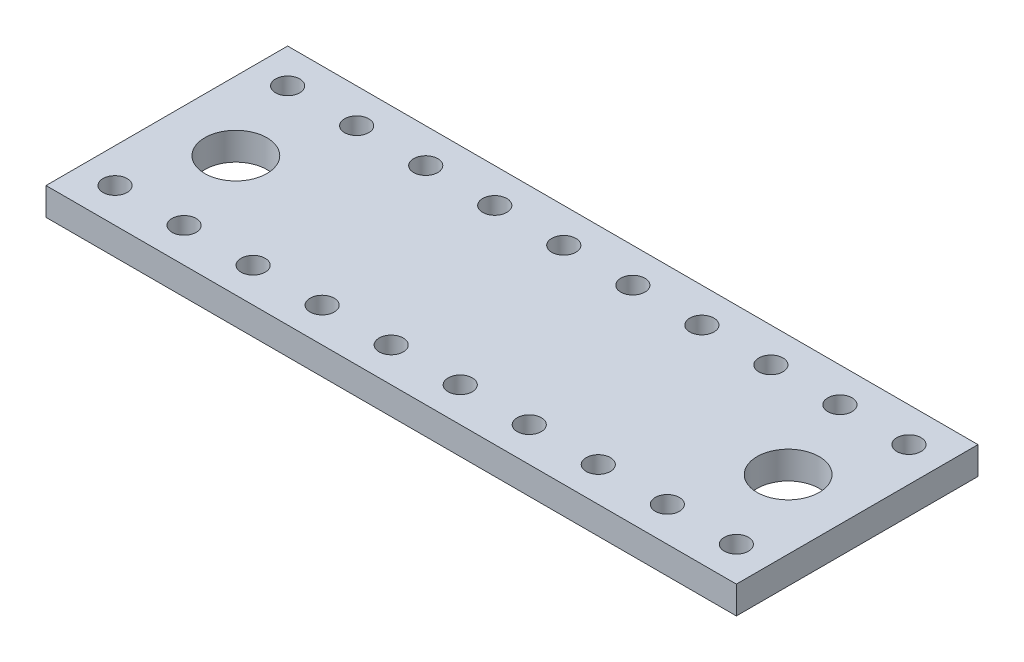
ISO-10303-21;
HEADER;
FILE_DESCRIPTION(('STEP AP214'),'2;1');
FILE_NAME('part.step','',(''),(''),'','','');
FILE_SCHEMA(('AUTOMOTIVE_DESIGN { 1 0 10303 214 1 1 1 1 }'));
ENDSEC;
DATA;
#1=APPLICATION_CONTEXT('core data for automotive mechanical design processes');
#2=APPLICATION_PROTOCOL_DEFINITION('international standard','automotive_design',2000,#1);
#3=PRODUCT_CONTEXT('',#1,'mechanical');
#4=PRODUCT('Part','Part','',(#3));
#5=PRODUCT_RELATED_PRODUCT_CATEGORY('part','',(#4));
#6=PRODUCT_DEFINITION_FORMATION('','',#4);
#7=PRODUCT_DEFINITION_CONTEXT('part definition',#1,'design');
#8=PRODUCT_DEFINITION('design','',#6,#7);
#9=PRODUCT_DEFINITION_SHAPE('','',#8);
#10=(LENGTH_UNIT() NAMED_UNIT(*) SI_UNIT(.MILLI.,.METRE.));
#11=(NAMED_UNIT(*) PLANE_ANGLE_UNIT() SI_UNIT($,.RADIAN.));
#12=(NAMED_UNIT(*) SI_UNIT($,.STERADIAN.) SOLID_ANGLE_UNIT());
#13=UNCERTAINTY_MEASURE_WITH_UNIT(LENGTH_MEASURE(1.E-05),#10,'distance_accuracy_value','');
#14=(GEOMETRIC_REPRESENTATION_CONTEXT(3) GLOBAL_UNCERTAINTY_ASSIGNED_CONTEXT((#13)) GLOBAL_UNIT_ASSIGNED_CONTEXT((#10,
#11,#12)) REPRESENTATION_CONTEXT('',''));
#15=CARTESIAN_POINT('',(0.,0.,0.));
#16=DIRECTION('',(0.,0.,1.));
#17=DIRECTION('',(1.,0.,0.));
#18=AXIS2_PLACEMENT_3D('',#15,#16,#17);
#19=CARTESIAN_POINT('',(95.,0.,-30.));
#20=DIRECTION('',(0.,1.,0.));
#21=DIRECTION('',(0.,0.,1.));
#22=AXIS2_PLACEMENT_3D('',#19,#20,#21);
#23=CYLINDRICAL_SURFACE('',#22,1.75);
#24=CARTESIAN_POINT('',(95.,0.,-30.));
#25=DIRECTION('',(0.,1.,0.));
#26=DIRECTION('',(0.,0.,1.));
#27=AXIS2_PLACEMENT_3D('',#24,#25,#26);
#28=CIRCLE('',#27,1.75);
#29=CARTESIAN_POINT('',(95.,0.,-28.25));
#30=VERTEX_POINT('',#29);
#31=EDGE_CURVE('E48',#30,#30,#28,.T.);
#32=ORIENTED_EDGE('',*,*,#31,.F.);
#33=EDGE_LOOP('',(#32));
#34=FACE_BOUND('',#33,.T.);
#35=CARTESIAN_POINT('',(95.,4.,-30.));
#36=DIRECTION('',(0.,-1.,0.));
#37=DIRECTION('',(0.,0.,-1.));
#38=AXIS2_PLACEMENT_3D('',#35,#36,#37);
#39=CIRCLE('',#38,1.75);
#40=CARTESIAN_POINT('',(95.,4.,-31.75));
#41=VERTEX_POINT('',#40);
#42=EDGE_CURVE('E11',#41,#41,#39,.T.);
#43=ORIENTED_EDGE('',*,*,#42,.F.);
#44=EDGE_LOOP('',(#43));
#45=FACE_BOUND('',#44,.T.);
#46=ADVANCED_FACE('F39',(#34,#45),#23,.F.);
#47=CARTESIAN_POINT('',(85.,0.,-30.));
#48=DIRECTION('',(0.,1.,0.));
#49=DIRECTION('',(0.,0.,1.));
#50=AXIS2_PLACEMENT_3D('',#47,#48,#49);
#51=CYLINDRICAL_SURFACE('',#50,1.75);
#52=CARTESIAN_POINT('',(85.,0.,-30.));
#53=DIRECTION('',(0.,1.,0.));
#54=DIRECTION('',(0.,0.,1.));
#55=AXIS2_PLACEMENT_3D('',#52,#53,#54);
#56=CIRCLE('',#55,1.75);
#57=CARTESIAN_POINT('',(85.,0.,-28.25));
#58=VERTEX_POINT('',#57);
#59=EDGE_CURVE('E177',#58,#58,#56,.T.);
#60=ORIENTED_EDGE('',*,*,#59,.F.);
#61=EDGE_LOOP('',(#60));
#62=FACE_BOUND('',#61,.T.);
#63=CARTESIAN_POINT('',(85.,4.,-30.));
#64=DIRECTION('',(0.,-1.,0.));
#65=DIRECTION('',(0.,0.,-1.));
#66=AXIS2_PLACEMENT_3D('',#63,#64,#65);
#67=CIRCLE('',#66,1.75);
#68=CARTESIAN_POINT('',(85.,4.,-31.75));
#69=VERTEX_POINT('',#68);
#70=EDGE_CURVE('E181',#69,#69,#67,.T.);
#71=ORIENTED_EDGE('',*,*,#70,.F.);
#72=EDGE_LOOP('',(#71));
#73=FACE_BOUND('',#72,.T.);
#74=ADVANCED_FACE('F192',(#62,#73),#51,.F.);
#75=CARTESIAN_POINT('',(75.,0.,-30.));
#76=DIRECTION('',(0.,1.,0.));
#77=DIRECTION('',(0.,0.,1.));
#78=AXIS2_PLACEMENT_3D('',#75,#76,#77);
#79=CYLINDRICAL_SURFACE('',#78,1.75);
#80=CARTESIAN_POINT('',(75.,0.,-30.));
#81=DIRECTION('',(0.,1.,0.));
#82=DIRECTION('',(0.,0.,1.));
#83=AXIS2_PLACEMENT_3D('',#80,#81,#82);
#84=CIRCLE('',#83,1.75);
#85=CARTESIAN_POINT('',(75.,0.,-28.25));
#86=VERTEX_POINT('',#85);
#87=EDGE_CURVE('E169',#86,#86,#84,.T.);
#88=ORIENTED_EDGE('',*,*,#87,.F.);
#89=EDGE_LOOP('',(#88));
#90=FACE_BOUND('',#89,.T.);
#91=CARTESIAN_POINT('',(75.,4.,-30.));
#92=DIRECTION('',(0.,-1.,0.));
#93=DIRECTION('',(0.,0.,-1.));
#94=AXIS2_PLACEMENT_3D('',#91,#92,#93);
#95=CIRCLE('',#94,1.75);
#96=CARTESIAN_POINT('',(75.,4.,-31.75));
#97=VERTEX_POINT('',#96);
#98=EDGE_CURVE('E173',#97,#97,#95,.T.);
#99=ORIENTED_EDGE('',*,*,#98,.F.);
#100=EDGE_LOOP('',(#99));
#101=FACE_BOUND('',#100,.T.);
#102=ADVANCED_FACE('F239',(#90,#101),#79,.F.);
#103=CARTESIAN_POINT('',(65.,0.,-30.));
#104=DIRECTION('',(0.,1.,0.));
#105=DIRECTION('',(0.,0.,1.));
#106=AXIS2_PLACEMENT_3D('',#103,#104,#105);
#107=CYLINDRICAL_SURFACE('',#106,1.75);
#108=CARTESIAN_POINT('',(65.,0.,-30.));
#109=DIRECTION('',(0.,1.,0.));
#110=DIRECTION('',(0.,0.,1.));
#111=AXIS2_PLACEMENT_3D('',#108,#109,#110);
#112=CIRCLE('',#111,1.75);
#113=CARTESIAN_POINT('',(65.,0.,-28.25));
#114=VERTEX_POINT('',#113);
#115=EDGE_CURVE('E161',#114,#114,#112,.T.);
#116=ORIENTED_EDGE('',*,*,#115,.F.);
#117=EDGE_LOOP('',(#116));
#118=FACE_BOUND('',#117,.T.);
#119=CARTESIAN_POINT('',(65.,4.,-30.));
#120=DIRECTION('',(0.,-1.,0.));
#121=DIRECTION('',(0.,0.,-1.));
#122=AXIS2_PLACEMENT_3D('',#119,#120,#121);
#123=CIRCLE('',#122,1.75);
#124=CARTESIAN_POINT('',(65.,4.,-31.75));
#125=VERTEX_POINT('',#124);
#126=EDGE_CURVE('E165',#125,#125,#123,.T.);
#127=ORIENTED_EDGE('',*,*,#126,.F.);
#128=EDGE_LOOP('',(#127));
#129=FACE_BOUND('',#128,.T.);
#130=ADVANCED_FACE('F235',(#118,#129),#107,.F.);
#131=CARTESIAN_POINT('',(55.,0.,-30.));
#132=DIRECTION('',(0.,1.,0.));
#133=DIRECTION('',(0.,0.,1.));
#134=AXIS2_PLACEMENT_3D('',#131,#132,#133);
#135=CYLINDRICAL_SURFACE('',#134,1.75);
#136=CARTESIAN_POINT('',(55.,0.,-30.));
#137=DIRECTION('',(0.,1.,0.));
#138=DIRECTION('',(0.,0.,1.));
#139=AXIS2_PLACEMENT_3D('',#136,#137,#138);
#140=CIRCLE('',#139,1.75);
#141=CARTESIAN_POINT('',(55.,0.,-28.25));
#142=VERTEX_POINT('',#141);
#143=EDGE_CURVE('E153',#142,#142,#140,.T.);
#144=ORIENTED_EDGE('',*,*,#143,.F.);
#145=EDGE_LOOP('',(#144));
#146=FACE_BOUND('',#145,.T.);
#147=CARTESIAN_POINT('',(55.,4.,-30.));
#148=DIRECTION('',(0.,-1.,0.));
#149=DIRECTION('',(0.,0.,-1.));
#150=AXIS2_PLACEMENT_3D('',#147,#148,#149);
#151=CIRCLE('',#150,1.75);
#152=CARTESIAN_POINT('',(55.,4.,-31.75));
#153=VERTEX_POINT('',#152);
#154=EDGE_CURVE('E157',#153,#153,#151,.T.);
#155=ORIENTED_EDGE('',*,*,#154,.F.);
#156=EDGE_LOOP('',(#155));
#157=FACE_BOUND('',#156,.T.);
#158=ADVANCED_FACE('F231',(#146,#157),#135,.F.);
#159=CARTESIAN_POINT('',(45.,0.,-30.));
#160=DIRECTION('',(0.,1.,0.));
#161=DIRECTION('',(0.,0.,1.));
#162=AXIS2_PLACEMENT_3D('',#159,#160,#161);
#163=CYLINDRICAL_SURFACE('',#162,1.75);
#164=CARTESIAN_POINT('',(45.,0.,-30.));
#165=DIRECTION('',(0.,1.,0.));
#166=DIRECTION('',(0.,0.,1.));
#167=AXIS2_PLACEMENT_3D('',#164,#165,#166);
#168=CIRCLE('',#167,1.75);
#169=CARTESIAN_POINT('',(45.,0.,-28.25));
#170=VERTEX_POINT('',#169);
#171=EDGE_CURVE('E145',#170,#170,#168,.T.);
#172=ORIENTED_EDGE('',*,*,#171,.F.);
#173=EDGE_LOOP('',(#172));
#174=FACE_BOUND('',#173,.T.);
#175=CARTESIAN_POINT('',(45.,4.,-30.));
#176=DIRECTION('',(0.,-1.,0.));
#177=DIRECTION('',(0.,0.,-1.));
#178=AXIS2_PLACEMENT_3D('',#175,#176,#177);
#179=CIRCLE('',#178,1.75);
#180=CARTESIAN_POINT('',(45.,4.,-31.75));
#181=VERTEX_POINT('',#180);
#182=EDGE_CURVE('E149',#181,#181,#179,.T.);
#183=ORIENTED_EDGE('',*,*,#182,.F.);
#184=EDGE_LOOP('',(#183));
#185=FACE_BOUND('',#184,.T.);
#186=ADVANCED_FACE('F227',(#174,#185),#163,.F.);
#187=CARTESIAN_POINT('',(35.,0.,-30.));
#188=DIRECTION('',(0.,1.,0.));
#189=DIRECTION('',(0.,0.,1.));
#190=AXIS2_PLACEMENT_3D('',#187,#188,#189);
#191=CYLINDRICAL_SURFACE('',#190,1.75);
#192=CARTESIAN_POINT('',(35.,0.,-30.));
#193=DIRECTION('',(0.,1.,0.));
#194=DIRECTION('',(0.,0.,1.));
#195=AXIS2_PLACEMENT_3D('',#192,#193,#194);
#196=CIRCLE('',#195,1.75);
#197=CARTESIAN_POINT('',(35.,0.,-28.25));
#198=VERTEX_POINT('',#197);
#199=EDGE_CURVE('E137',#198,#198,#196,.T.);
#200=ORIENTED_EDGE('',*,*,#199,.F.);
#201=EDGE_LOOP('',(#200));
#202=FACE_BOUND('',#201,.T.);
#203=CARTESIAN_POINT('',(35.,4.,-30.));
#204=DIRECTION('',(0.,-1.,0.));
#205=DIRECTION('',(0.,0.,-1.));
#206=AXIS2_PLACEMENT_3D('',#203,#204,#205);
#207=CIRCLE('',#206,1.75);
#208=CARTESIAN_POINT('',(35.,4.,-31.75));
#209=VERTEX_POINT('',#208);
#210=EDGE_CURVE('E141',#209,#209,#207,.T.);
#211=ORIENTED_EDGE('',*,*,#210,.F.);
#212=EDGE_LOOP('',(#211));
#213=FACE_BOUND('',#212,.T.);
#214=ADVANCED_FACE('F223',(#202,#213),#191,.F.);
#215=CARTESIAN_POINT('',(25.,0.,-30.));
#216=DIRECTION('',(0.,1.,0.));
#217=DIRECTION('',(0.,0.,1.));
#218=AXIS2_PLACEMENT_3D('',#215,#216,#217);
#219=CYLINDRICAL_SURFACE('',#218,1.75);
#220=CARTESIAN_POINT('',(25.,0.,-30.));
#221=DIRECTION('',(0.,1.,0.));
#222=DIRECTION('',(0.,0.,1.));
#223=AXIS2_PLACEMENT_3D('',#220,#221,#222);
#224=CIRCLE('',#223,1.75);
#225=CARTESIAN_POINT('',(25.,0.,-28.25));
#226=VERTEX_POINT('',#225);
#227=EDGE_CURVE('E129',#226,#226,#224,.T.);
#228=ORIENTED_EDGE('',*,*,#227,.F.);
#229=EDGE_LOOP('',(#228));
#230=FACE_BOUND('',#229,.T.);
#231=CARTESIAN_POINT('',(25.,4.,-30.));
#232=DIRECTION('',(0.,-1.,0.));
#233=DIRECTION('',(0.,0.,-1.));
#234=AXIS2_PLACEMENT_3D('',#231,#232,#233);
#235=CIRCLE('',#234,1.75);
#236=CARTESIAN_POINT('',(25.,4.,-31.75));
#237=VERTEX_POINT('',#236);
#238=EDGE_CURVE('E133',#237,#237,#235,.T.);
#239=ORIENTED_EDGE('',*,*,#238,.F.);
#240=EDGE_LOOP('',(#239));
#241=FACE_BOUND('',#240,.T.);
#242=ADVANCED_FACE('F219',(#230,#241),#219,.F.);
#243=CARTESIAN_POINT('',(0.,4.,0.));
#244=DIRECTION('',(1.,0.,0.));
#245=DIRECTION('',(0.,0.,-1.));
#246=AXIS2_PLACEMENT_3D('',#243,#244,#245);
#247=PLANE('',#246);
#248=DIRECTION('',(0.,0.,1.));
#249=VECTOR('',#248,1.);
#250=CARTESIAN_POINT('',(0.,0.,0.));
#251=LINE('',#250,#249);
#252=CARTESIAN_POINT('',(0.,0.,-35.));
#253=VERTEX_POINT('',#252);
#254=CARTESIAN_POINT('',(0.,0.,0.));
#255=VERTEX_POINT('',#254);
#256=EDGE_CURVE('E112',#253,#255,#251,.T.);
#257=ORIENTED_EDGE('',*,*,#256,.T.);
#258=DIRECTION('',(0.,-1.,0.));
#259=VECTOR('',#258,1.);
#260=CARTESIAN_POINT('',(0.,4.,0.));
#261=LINE('',#260,#259);
#262=CARTESIAN_POINT('',(0.,4.,0.));
#263=VERTEX_POINT('',#262);
#264=EDGE_CURVE('E101',#263,#255,#261,.T.);
#265=ORIENTED_EDGE('',*,*,#264,.F.);
#266=DIRECTION('',(0.,0.,1.));
#267=VECTOR('',#266,1.);
#268=CARTESIAN_POINT('',(0.,4.,0.));
#269=LINE('',#268,#267);
#270=CARTESIAN_POINT('',(0.,4.,-35.));
#271=VERTEX_POINT('',#270);
#272=EDGE_CURVE('E93',#271,#263,#269,.T.);
#273=ORIENTED_EDGE('',*,*,#272,.F.);
#274=DIRECTION('',(0.,-1.,0.));
#275=VECTOR('',#274,1.);
#276=CARTESIAN_POINT('',(0.,4.,-35.));
#277=LINE('',#276,#275);
#278=EDGE_CURVE('E108',#271,#253,#277,.T.);
#279=ORIENTED_EDGE('',*,*,#278,.T.);
#280=EDGE_LOOP('',(#257,#265,#273,#279));
#281=FACE_BOUND('',#280,.T.);
#282=ADVANCED_FACE('F216',(#281),#247,.F.);
#283=CARTESIAN_POINT('',(0.,4.,0.));
#284=DIRECTION('',(0.,0.,-1.));
#285=DIRECTION('',(-1.,0.,0.));
#286=AXIS2_PLACEMENT_3D('',#283,#284,#285);
#287=PLANE('',#286);
#288=DIRECTION('',(1.,0.,0.));
#289=VECTOR('',#288,1.);
#290=CARTESIAN_POINT('',(0.,0.,0.));
#291=LINE('',#290,#289);
#292=CARTESIAN_POINT('',(100.,0.,0.));
#293=VERTEX_POINT('',#292);
#294=EDGE_CURVE('E99',#255,#293,#291,.T.);
#295=ORIENTED_EDGE('',*,*,#294,.T.);
#296=DIRECTION('',(0.,-1.,0.));
#297=VECTOR('',#296,1.);
#298=CARTESIAN_POINT('',(100.,4.,0.));
#299=LINE('',#298,#297);
#300=CARTESIAN_POINT('',(100.,4.,0.));
#301=VERTEX_POINT('',#300);
#302=EDGE_CURVE('E97',#301,#293,#299,.T.);
#303=ORIENTED_EDGE('',*,*,#302,.F.);
#304=DIRECTION('',(1.,0.,0.));
#305=VECTOR('',#304,1.);
#306=CARTESIAN_POINT('',(0.,4.,0.));
#307=LINE('',#306,#305);
#308=EDGE_CURVE('E87',#263,#301,#307,.T.);
#309=ORIENTED_EDGE('',*,*,#308,.F.);
#310=ORIENTED_EDGE('',*,*,#264,.T.);
#311=EDGE_LOOP('',(#295,#303,#309,#310));
#312=FACE_BOUND('',#311,.T.);
#313=ADVANCED_FACE('F98',(#312),#287,.F.);
#314=CARTESIAN_POINT('',(100.,4.,0.));
#315=DIRECTION('',(-1.,0.,0.));
#316=DIRECTION('',(0.,0.,1.));
#317=AXIS2_PLACEMENT_3D('',#314,#315,#316);
#318=PLANE('',#317);
#319=DIRECTION('',(0.,0.,-1.));
#320=VECTOR('',#319,1.);
#321=CARTESIAN_POINT('',(100.,0.,0.));
#322=LINE('',#321,#320);
#323=CARTESIAN_POINT('',(100.,0.,-35.));
#324=VERTEX_POINT('',#323);
#325=EDGE_CURVE('E73',#293,#324,#322,.T.);
#326=ORIENTED_EDGE('',*,*,#325,.T.);
#327=DIRECTION('',(0.,-1.,0.));
#328=VECTOR('',#327,1.);
#329=CARTESIAN_POINT('',(100.,4.,-35.));
#330=LINE('',#329,#328);
#331=CARTESIAN_POINT('',(100.,4.,-35.));
#332=VERTEX_POINT('',#331);
#333=EDGE_CURVE('E102',#332,#324,#330,.T.);
#334=ORIENTED_EDGE('',*,*,#333,.F.);
#335=DIRECTION('',(0.,0.,-1.));
#336=VECTOR('',#335,1.);
#337=CARTESIAN_POINT('',(100.,4.,0.));
#338=LINE('',#337,#336);
#339=EDGE_CURVE('E91',#301,#332,#338,.T.);
#340=ORIENTED_EDGE('',*,*,#339,.F.);
#341=ORIENTED_EDGE('',*,*,#302,.T.);
#342=EDGE_LOOP('',(#326,#334,#340,#341));
#343=FACE_BOUND('',#342,.T.);
#344=ADVANCED_FACE('F104',(#343),#318,.F.);
#345=CARTESIAN_POINT('',(0.,4.,-35.));
#346=DIRECTION('',(0.,0.,1.));
#347=DIRECTION('',(1.,0.,0.));
#348=AXIS2_PLACEMENT_3D('',#345,#346,#347);
#349=PLANE('',#348);
#350=DIRECTION('',(-1.,0.,0.));
#351=VECTOR('',#350,1.);
#352=CARTESIAN_POINT('',(0.,0.,-35.));
#353=LINE('',#352,#351);
#354=EDGE_CURVE('E79',#324,#253,#353,.T.);
#355=ORIENTED_EDGE('',*,*,#354,.T.);
#356=ORIENTED_EDGE('',*,*,#278,.F.);
#357=DIRECTION('',(-1.,0.,0.));
#358=VECTOR('',#357,1.);
#359=CARTESIAN_POINT('',(0.,4.,-35.));
#360=LINE('',#359,#358);
#361=EDGE_CURVE('E56',#332,#271,#360,.T.);
#362=ORIENTED_EDGE('',*,*,#361,.F.);
#363=ORIENTED_EDGE('',*,*,#333,.T.);
#364=EDGE_LOOP('',(#355,#356,#362,#363));
#365=FACE_BOUND('',#364,.T.);
#366=ADVANCED_FACE('F196',(#365),#349,.F.);
#367=CARTESIAN_POINT('',(0.,4.,0.));
#368=DIRECTION('',(0.,-1.,0.));
#369=DIRECTION('',(0.,0.,-1.));
#370=AXIS2_PLACEMENT_3D('',#367,#368,#369);
#371=PLANE('',#370);
#372=CARTESIAN_POINT('',(90.,4.,-17.5));
#373=DIRECTION('',(0.,-1.,0.));
#374=DIRECTION('',(0.,0.,1.));
#375=AXIS2_PLACEMENT_3D('',#372,#373,#374);
#376=CIRCLE('',#375,4.5);
#377=CARTESIAN_POINT('',(90.,4.,-13.));
#378=VERTEX_POINT('',#377);
#379=EDGE_CURVE('E468',#378,#378,#376,.T.);
#380=ORIENTED_EDGE('',*,*,#379,.T.);
#381=EDGE_LOOP('',(#380));
#382=FACE_BOUND('',#381,.T.);
#383=CARTESIAN_POINT('',(10.,4.,-17.5));
#384=DIRECTION('',(0.,1.,0.));
#385=DIRECTION('',(0.,0.,1.));
#386=AXIS2_PLACEMENT_3D('',#383,#384,#385);
#387=CIRCLE('',#386,4.5);
#388=CARTESIAN_POINT('',(10.,4.,-13.));
#389=VERTEX_POINT('',#388);
#390=EDGE_CURVE('E472',#389,#389,#387,.T.);
#391=ORIENTED_EDGE('',*,*,#390,.F.);
#392=EDGE_LOOP('',(#391));
#393=FACE_BOUND('',#392,.T.);
#394=CARTESIAN_POINT('',(5.,4.,-4.99999999999999));
#395=DIRECTION('',(0.,-1.,0.));
#396=DIRECTION('',(0.,0.,-1.));
#397=AXIS2_PLACEMENT_3D('',#394,#395,#396);
#398=CIRCLE('',#397,1.75);
#399=CARTESIAN_POINT('',(5.,4.,-6.75));
#400=VERTEX_POINT('',#399);
#401=EDGE_CURVE('E558',#400,#400,#398,.F.);
#402=ORIENTED_EDGE('',*,*,#401,.F.);
#403=EDGE_LOOP('',(#402));
#404=FACE_BOUND('',#403,.T.);
#405=CARTESIAN_POINT('',(15.,4.,-4.99999999999999));
#406=DIRECTION('',(0.,-1.,0.));
#407=DIRECTION('',(0.,0.,-1.));
#408=AXIS2_PLACEMENT_3D('',#405,#406,#407);
#409=CIRCLE('',#408,1.75);
#410=CARTESIAN_POINT('',(15.,4.,-6.75));
#411=VERTEX_POINT('',#410);
#412=EDGE_CURVE('E554',#411,#411,#409,.F.);
#413=ORIENTED_EDGE('',*,*,#412,.F.);
#414=EDGE_LOOP('',(#413));
#415=FACE_BOUND('',#414,.T.);
#416=CARTESIAN_POINT('',(25.,4.,-4.99999999999999));
#417=DIRECTION('',(0.,-1.,0.));
#418=DIRECTION('',(0.,0.,-1.));
#419=AXIS2_PLACEMENT_3D('',#416,#417,#418);
#420=CIRCLE('',#419,1.75);
#421=CARTESIAN_POINT('',(25.,4.,-6.75));
#422=VERTEX_POINT('',#421);
#423=EDGE_CURVE('E550',#422,#422,#420,.F.);
#424=ORIENTED_EDGE('',*,*,#423,.F.);
#425=EDGE_LOOP('',(#424));
#426=FACE_BOUND('',#425,.T.);
#427=CARTESIAN_POINT('',(35.,4.,-4.99999999999999));
#428=DIRECTION('',(0.,-1.,0.));
#429=DIRECTION('',(0.,0.,-1.));
#430=AXIS2_PLACEMENT_3D('',#427,#428,#429);
#431=CIRCLE('',#430,1.75);
#432=CARTESIAN_POINT('',(35.,4.,-6.75));
#433=VERTEX_POINT('',#432);
#434=EDGE_CURVE('E546',#433,#433,#431,.F.);
#435=ORIENTED_EDGE('',*,*,#434,.F.);
#436=EDGE_LOOP('',(#435));
#437=FACE_BOUND('',#436,.T.);
#438=CARTESIAN_POINT('',(45.,4.,-4.99999999999999));
#439=DIRECTION('',(0.,-1.,0.));
#440=DIRECTION('',(0.,0.,-1.));
#441=AXIS2_PLACEMENT_3D('',#438,#439,#440);
#442=CIRCLE('',#441,1.75);
#443=CARTESIAN_POINT('',(45.,4.,-6.75));
#444=VERTEX_POINT('',#443);
#445=EDGE_CURVE('E542',#444,#444,#442,.F.);
#446=ORIENTED_EDGE('',*,*,#445,.F.);
#447=EDGE_LOOP('',(#446));
#448=FACE_BOUND('',#447,.T.);
#449=CARTESIAN_POINT('',(55.,4.,-4.99999999999999));
#450=DIRECTION('',(0.,-1.,0.));
#451=DIRECTION('',(0.,0.,-1.));
#452=AXIS2_PLACEMENT_3D('',#449,#450,#451);
#453=CIRCLE('',#452,1.75);
#454=CARTESIAN_POINT('',(55.,4.,-6.75));
#455=VERTEX_POINT('',#454);
#456=EDGE_CURVE('E538',#455,#455,#453,.F.);
#457=ORIENTED_EDGE('',*,*,#456,.F.);
#458=EDGE_LOOP('',(#457));
#459=FACE_BOUND('',#458,.T.);
#460=CARTESIAN_POINT('',(65.,4.,-4.99999999999999));
#461=DIRECTION('',(0.,-1.,0.));
#462=DIRECTION('',(0.,0.,-1.));
#463=AXIS2_PLACEMENT_3D('',#460,#461,#462);
#464=CIRCLE('',#463,1.75);
#465=CARTESIAN_POINT('',(65.,4.,-6.75));
#466=VERTEX_POINT('',#465);
#467=EDGE_CURVE('E534',#466,#466,#464,.F.);
#468=ORIENTED_EDGE('',*,*,#467,.F.);
#469=EDGE_LOOP('',(#468));
#470=FACE_BOUND('',#469,.T.);
#471=CARTESIAN_POINT('',(75.,4.,-4.99999999999999));
#472=DIRECTION('',(0.,-1.,0.));
#473=DIRECTION('',(0.,0.,-1.));
#474=AXIS2_PLACEMENT_3D('',#471,#472,#473);
#475=CIRCLE('',#474,1.75);
#476=CARTESIAN_POINT('',(75.,4.,-6.75));
#477=VERTEX_POINT('',#476);
#478=EDGE_CURVE('E530',#477,#477,#475,.F.);
#479=ORIENTED_EDGE('',*,*,#478,.F.);
#480=EDGE_LOOP('',(#479));
#481=FACE_BOUND('',#480,.T.);
#482=CARTESIAN_POINT('',(85.,4.,-4.99999999999999));
#483=DIRECTION('',(0.,-1.,0.));
#484=DIRECTION('',(0.,0.,-1.));
#485=AXIS2_PLACEMENT_3D('',#482,#483,#484);
#486=CIRCLE('',#485,1.75);
#487=CARTESIAN_POINT('',(85.,4.,-6.75));
#488=VERTEX_POINT('',#487);
#489=EDGE_CURVE('E526',#488,#488,#486,.F.);
#490=ORIENTED_EDGE('',*,*,#489,.F.);
#491=EDGE_LOOP('',(#490));
#492=FACE_BOUND('',#491,.T.);
#493=CARTESIAN_POINT('',(95.,4.,-4.99999999999999));
#494=DIRECTION('',(0.,-1.,0.));
#495=DIRECTION('',(0.,0.,-1.));
#496=AXIS2_PLACEMENT_3D('',#493,#494,#495);
#497=CIRCLE('',#496,1.75);
#498=CARTESIAN_POINT('',(95.,4.,-6.75));
#499=VERTEX_POINT('',#498);
#500=EDGE_CURVE('E487',#499,#499,#497,.F.);
#501=ORIENTED_EDGE('',*,*,#500,.F.);
#502=EDGE_LOOP('',(#501));
#503=FACE_BOUND('',#502,.T.);
#504=CARTESIAN_POINT('',(15.,4.,-30.));
#505=DIRECTION('',(0.,-1.,0.));
#506=DIRECTION('',(0.,0.,-1.));
#507=AXIS2_PLACEMENT_3D('',#504,#505,#506);
#508=CIRCLE('',#507,1.75);
#509=CARTESIAN_POINT('',(15.,4.,-31.75));
#510=VERTEX_POINT('',#509);
#511=EDGE_CURVE('E566',#510,#510,#508,.T.);
#512=ORIENTED_EDGE('',*,*,#511,.T.);
#513=EDGE_LOOP('',(#512));
#514=FACE_BOUND('',#513,.T.);
#515=CARTESIAN_POINT('',(5.,4.,-30.));
#516=DIRECTION('',(0.,-1.,0.));
#517=DIRECTION('',(0.,0.,-1.));
#518=AXIS2_PLACEMENT_3D('',#515,#516,#517);
#519=CIRCLE('',#518,1.75);
#520=CARTESIAN_POINT('',(5.,4.,-31.75));
#521=VERTEX_POINT('',#520);
#522=EDGE_CURVE('E116',#521,#521,#519,.T.);
#523=ORIENTED_EDGE('',*,*,#522,.T.);
#524=EDGE_LOOP('',(#523));
#525=FACE_BOUND('',#524,.T.);
#526=ORIENTED_EDGE('',*,*,#272,.T.);
#527=ORIENTED_EDGE('',*,*,#308,.T.);
#528=ORIENTED_EDGE('',*,*,#339,.T.);
#529=ORIENTED_EDGE('',*,*,#361,.T.);
#530=EDGE_LOOP('',(#526,#527,#528,#529));
#531=FACE_BOUND('',#530,.T.);
#532=ORIENTED_EDGE('',*,*,#238,.T.);
#533=EDGE_LOOP('',(#532));
#534=FACE_BOUND('',#533,.T.);
#535=ORIENTED_EDGE('',*,*,#210,.T.);
#536=EDGE_LOOP('',(#535));
#537=FACE_BOUND('',#536,.T.);
#538=ORIENTED_EDGE('',*,*,#182,.T.);
#539=EDGE_LOOP('',(#538));
#540=FACE_BOUND('',#539,.T.);
#541=ORIENTED_EDGE('',*,*,#154,.T.);
#542=EDGE_LOOP('',(#541));
#543=FACE_BOUND('',#542,.T.);
#544=ORIENTED_EDGE('',*,*,#126,.T.);
#545=EDGE_LOOP('',(#544));
#546=FACE_BOUND('',#545,.T.);
#547=ORIENTED_EDGE('',*,*,#98,.T.);
#548=EDGE_LOOP('',(#547));
#549=FACE_BOUND('',#548,.T.);
#550=ORIENTED_EDGE('',*,*,#70,.T.);
#551=EDGE_LOOP('',(#550));
#552=FACE_BOUND('',#551,.T.);
#553=ORIENTED_EDGE('',*,*,#42,.T.);
#554=EDGE_LOOP('',(#553));
#555=FACE_BOUND('',#554,.T.);
#556=ADVANCED_FACE('F88',(#382,#393,#404,#415,#426,#437,#448,#459,#470,#481,#492,#503,#514,#525,
#531,#534,#537,#540,#543,#546,#549,#552,#555),#371,.F.);
#557=CARTESIAN_POINT('',(0.,0.,0.));
#558=DIRECTION('',(0.,-1.,0.));
#559=DIRECTION('',(0.,0.,-1.));
#560=AXIS2_PLACEMENT_3D('',#557,#558,#559);
#561=PLANE('',#560);
#562=CARTESIAN_POINT('',(90.,0.,-17.5));
#563=DIRECTION('',(0.,-1.,0.));
#564=DIRECTION('',(0.,0.,1.));
#565=AXIS2_PLACEMENT_3D('',#562,#563,#564);
#566=CIRCLE('',#565,4.5);
#567=CARTESIAN_POINT('',(90.,0.,-13.));
#568=VERTEX_POINT('',#567);
#569=EDGE_CURVE('E466',#568,#568,#566,.T.);
#570=ORIENTED_EDGE('',*,*,#569,.F.);
#571=EDGE_LOOP('',(#570));
#572=FACE_BOUND('',#571,.T.);
#573=CARTESIAN_POINT('',(10.,0.,-17.5));
#574=DIRECTION('',(0.,1.,0.));
#575=DIRECTION('',(0.,0.,1.));
#576=AXIS2_PLACEMENT_3D('',#573,#574,#575);
#577=CIRCLE('',#576,4.5);
#578=CARTESIAN_POINT('',(10.,0.,-13.));
#579=VERTEX_POINT('',#578);
#580=EDGE_CURVE('E475',#579,#579,#577,.T.);
#581=ORIENTED_EDGE('',*,*,#580,.T.);
#582=EDGE_LOOP('',(#581));
#583=FACE_BOUND('',#582,.T.);
#584=CARTESIAN_POINT('',(5.,0.,-4.99999999999999));
#585=DIRECTION('',(0.,-1.,0.));
#586=DIRECTION('',(0.,0.,-1.));
#587=AXIS2_PLACEMENT_3D('',#584,#585,#586);
#588=CIRCLE('',#587,1.75);
#589=CARTESIAN_POINT('',(5.,0.,-6.75));
#590=VERTEX_POINT('',#589);
#591=EDGE_CURVE('E483',#590,#590,#588,.T.);
#592=ORIENTED_EDGE('',*,*,#591,.F.);
#593=EDGE_LOOP('',(#592));
#594=FACE_BOUND('',#593,.T.);
#595=CARTESIAN_POINT('',(15.,0.,-4.99999999999999));
#596=DIRECTION('',(0.,-1.,0.));
#597=DIRECTION('',(0.,0.,-1.));
#598=AXIS2_PLACEMENT_3D('',#595,#596,#597);
#599=CIRCLE('',#598,1.75);
#600=CARTESIAN_POINT('',(15.,0.,-6.75));
#601=VERTEX_POINT('',#600);
#602=EDGE_CURVE('E488',#601,#601,#599,.T.);
#603=ORIENTED_EDGE('',*,*,#602,.F.);
#604=EDGE_LOOP('',(#603));
#605=FACE_BOUND('',#604,.T.);
#606=CARTESIAN_POINT('',(25.,0.,-4.99999999999999));
#607=DIRECTION('',(0.,-1.,0.));
#608=DIRECTION('',(0.,0.,-1.));
#609=AXIS2_PLACEMENT_3D('',#606,#607,#608);
#610=CIRCLE('',#609,1.75);
#611=CARTESIAN_POINT('',(25.,0.,-6.75));
#612=VERTEX_POINT('',#611);
#613=EDGE_CURVE('E492',#612,#612,#610,.T.);
#614=ORIENTED_EDGE('',*,*,#613,.F.);
#615=EDGE_LOOP('',(#614));
#616=FACE_BOUND('',#615,.T.);
#617=CARTESIAN_POINT('',(35.,0.,-4.99999999999999));
#618=DIRECTION('',(0.,-1.,0.));
#619=DIRECTION('',(0.,0.,-1.));
#620=AXIS2_PLACEMENT_3D('',#617,#618,#619);
#621=CIRCLE('',#620,1.75);
#622=CARTESIAN_POINT('',(35.,0.,-6.75));
#623=VERTEX_POINT('',#622);
#624=EDGE_CURVE('E496',#623,#623,#621,.T.);
#625=ORIENTED_EDGE('',*,*,#624,.F.);
#626=EDGE_LOOP('',(#625));
#627=FACE_BOUND('',#626,.T.);
#628=CARTESIAN_POINT('',(45.,0.,-4.99999999999999));
#629=DIRECTION('',(0.,-1.,0.));
#630=DIRECTION('',(0.,0.,-1.));
#631=AXIS2_PLACEMENT_3D('',#628,#629,#630);
#632=CIRCLE('',#631,1.75);
#633=CARTESIAN_POINT('',(45.,0.,-6.75));
#634=VERTEX_POINT('',#633);
#635=EDGE_CURVE('E500',#634,#634,#632,.T.);
#636=ORIENTED_EDGE('',*,*,#635,.F.);
#637=EDGE_LOOP('',(#636));
#638=FACE_BOUND('',#637,.T.);
#639=CARTESIAN_POINT('',(55.,0.,-4.99999999999999));
#640=DIRECTION('',(0.,-1.,0.));
#641=DIRECTION('',(0.,0.,-1.));
#642=AXIS2_PLACEMENT_3D('',#639,#640,#641);
#643=CIRCLE('',#642,1.75);
#644=CARTESIAN_POINT('',(55.,0.,-6.75));
#645=VERTEX_POINT('',#644);
#646=EDGE_CURVE('E504',#645,#645,#643,.T.);
#647=ORIENTED_EDGE('',*,*,#646,.F.);
#648=EDGE_LOOP('',(#647));
#649=FACE_BOUND('',#648,.T.);
#650=CARTESIAN_POINT('',(65.,0.,-4.99999999999999));
#651=DIRECTION('',(0.,-1.,0.));
#652=DIRECTION('',(0.,0.,-1.));
#653=AXIS2_PLACEMENT_3D('',#650,#651,#652);
#654=CIRCLE('',#653,1.75);
#655=CARTESIAN_POINT('',(65.,0.,-6.75));
#656=VERTEX_POINT('',#655);
#657=EDGE_CURVE('E508',#656,#656,#654,.T.);
#658=ORIENTED_EDGE('',*,*,#657,.F.);
#659=EDGE_LOOP('',(#658));
#660=FACE_BOUND('',#659,.T.);
#661=CARTESIAN_POINT('',(75.,0.,-4.99999999999999));
#662=DIRECTION('',(0.,-1.,0.));
#663=DIRECTION('',(0.,0.,-1.));
#664=AXIS2_PLACEMENT_3D('',#661,#662,#663);
#665=CIRCLE('',#664,1.75);
#666=CARTESIAN_POINT('',(75.,0.,-6.75));
#667=VERTEX_POINT('',#666);
#668=EDGE_CURVE('E512',#667,#667,#665,.T.);
#669=ORIENTED_EDGE('',*,*,#668,.F.);
#670=EDGE_LOOP('',(#669));
#671=FACE_BOUND('',#670,.T.);
#672=CARTESIAN_POINT('',(85.,0.,-4.99999999999999));
#673=DIRECTION('',(0.,-1.,0.));
#674=DIRECTION('',(0.,0.,-1.));
#675=AXIS2_PLACEMENT_3D('',#672,#673,#674);
#676=CIRCLE('',#675,1.75);
#677=CARTESIAN_POINT('',(85.,0.,-6.75));
#678=VERTEX_POINT('',#677);
#679=EDGE_CURVE('E516',#678,#678,#676,.T.);
#680=ORIENTED_EDGE('',*,*,#679,.F.);
#681=EDGE_LOOP('',(#680));
#682=FACE_BOUND('',#681,.T.);
#683=CARTESIAN_POINT('',(95.,0.,-4.99999999999999));
#684=DIRECTION('',(0.,-1.,0.));
#685=DIRECTION('',(0.,0.,-1.));
#686=AXIS2_PLACEMENT_3D('',#683,#684,#685);
#687=CIRCLE('',#686,1.75);
#688=CARTESIAN_POINT('',(95.,0.,-6.75));
#689=VERTEX_POINT('',#688);
#690=EDGE_CURVE('E479',#689,#689,#687,.T.);
#691=ORIENTED_EDGE('',*,*,#690,.F.);
#692=EDGE_LOOP('',(#691));
#693=FACE_BOUND('',#692,.T.);
#694=CARTESIAN_POINT('',(15.,0.,-30.));
#695=DIRECTION('',(0.,1.,0.));
#696=DIRECTION('',(0.,0.,1.));
#697=AXIS2_PLACEMENT_3D('',#694,#695,#696);
#698=CIRCLE('',#697,1.75);
#699=CARTESIAN_POINT('',(15.,0.,-28.25));
#700=VERTEX_POINT('',#699);
#701=EDGE_CURVE('E562',#700,#700,#698,.T.);
#702=ORIENTED_EDGE('',*,*,#701,.T.);
#703=EDGE_LOOP('',(#702));
#704=FACE_BOUND('',#703,.T.);
#705=CARTESIAN_POINT('',(5.,0.,-30.));
#706=DIRECTION('',(0.,1.,0.));
#707=DIRECTION('',(0.,0.,1.));
#708=AXIS2_PLACEMENT_3D('',#705,#706,#707);
#709=CIRCLE('',#708,1.75);
#710=CARTESIAN_POINT('',(5.,0.,-28.25));
#711=VERTEX_POINT('',#710);
#712=EDGE_CURVE('E570',#711,#711,#709,.T.);
#713=ORIENTED_EDGE('',*,*,#712,.T.);
#714=EDGE_LOOP('',(#713));
#715=FACE_BOUND('',#714,.T.);
#716=ORIENTED_EDGE('',*,*,#256,.F.);
#717=ORIENTED_EDGE('',*,*,#354,.F.);
#718=ORIENTED_EDGE('',*,*,#325,.F.);
#719=ORIENTED_EDGE('',*,*,#294,.F.);
#720=EDGE_LOOP('',(#716,#717,#718,#719));
#721=FACE_BOUND('',#720,.T.);
#722=ORIENTED_EDGE('',*,*,#227,.T.);
#723=EDGE_LOOP('',(#722));
#724=FACE_BOUND('',#723,.T.);
#725=ORIENTED_EDGE('',*,*,#199,.T.);
#726=EDGE_LOOP('',(#725));
#727=FACE_BOUND('',#726,.T.);
#728=ORIENTED_EDGE('',*,*,#171,.T.);
#729=EDGE_LOOP('',(#728));
#730=FACE_BOUND('',#729,.T.);
#731=ORIENTED_EDGE('',*,*,#143,.T.);
#732=EDGE_LOOP('',(#731));
#733=FACE_BOUND('',#732,.T.);
#734=ORIENTED_EDGE('',*,*,#115,.T.);
#735=EDGE_LOOP('',(#734));
#736=FACE_BOUND('',#735,.T.);
#737=ORIENTED_EDGE('',*,*,#87,.T.);
#738=EDGE_LOOP('',(#737));
#739=FACE_BOUND('',#738,.T.);
#740=ORIENTED_EDGE('',*,*,#59,.T.);
#741=EDGE_LOOP('',(#740));
#742=FACE_BOUND('',#741,.T.);
#743=ORIENTED_EDGE('',*,*,#31,.T.);
#744=EDGE_LOOP('',(#743));
#745=FACE_BOUND('',#744,.T.);
#746=ADVANCED_FACE('F188',(#572,#583,#594,#605,#616,#627,#638,#649,#660,#671,#682,#693,#704,
#715,#721,#724,#727,#730,#733,#736,#739,#742,#745),#561,.T.);
#747=CARTESIAN_POINT('',(5.,0.,-30.));
#748=DIRECTION('',(0.,1.,0.));
#749=DIRECTION('',(0.,0.,1.));
#750=AXIS2_PLACEMENT_3D('',#747,#748,#749);
#751=CYLINDRICAL_SURFACE('',#750,1.75);
#752=ORIENTED_EDGE('',*,*,#712,.F.);
#753=EDGE_LOOP('',(#752));
#754=FACE_BOUND('',#753,.T.);
#755=ORIENTED_EDGE('',*,*,#522,.F.);
#756=EDGE_LOOP('',(#755));
#757=FACE_BOUND('',#756,.T.);
#758=ADVANCED_FACE('F203',(#754,#757),#751,.F.);
#759=CARTESIAN_POINT('',(15.,0.,-30.));
#760=DIRECTION('',(0.,1.,0.));
#761=DIRECTION('',(0.,0.,1.));
#762=AXIS2_PLACEMENT_3D('',#759,#760,#761);
#763=CYLINDRICAL_SURFACE('',#762,1.75);
#764=ORIENTED_EDGE('',*,*,#701,.F.);
#765=EDGE_LOOP('',(#764));
#766=FACE_BOUND('',#765,.T.);
#767=ORIENTED_EDGE('',*,*,#511,.F.);
#768=EDGE_LOOP('',(#767));
#769=FACE_BOUND('',#768,.T.);
#770=ADVANCED_FACE('F304',(#766,#769),#763,.F.);
#771=CARTESIAN_POINT('',(95.,0.,-4.99999999999999));
#772=DIRECTION('',(0.,1.,0.));
#773=DIRECTION('',(0.,0.,1.));
#774=AXIS2_PLACEMENT_3D('',#771,#772,#773);
#775=CYLINDRICAL_SURFACE('',#774,1.75);
#776=ORIENTED_EDGE('',*,*,#690,.T.);
#777=EDGE_LOOP('',(#776));
#778=FACE_BOUND('',#777,.T.);
#779=ORIENTED_EDGE('',*,*,#500,.T.);
#780=EDGE_LOOP('',(#779));
#781=FACE_BOUND('',#780,.T.);
#782=ADVANCED_FACE('F333',(#778,#781),#775,.F.);
#783=CARTESIAN_POINT('',(85.,0.,-4.99999999999999));
#784=DIRECTION('',(0.,1.,0.));
#785=DIRECTION('',(0.,0.,1.));
#786=AXIS2_PLACEMENT_3D('',#783,#784,#785);
#787=CYLINDRICAL_SURFACE('',#786,1.75);
#788=ORIENTED_EDGE('',*,*,#679,.T.);
#789=EDGE_LOOP('',(#788));
#790=FACE_BOUND('',#789,.T.);
#791=ORIENTED_EDGE('',*,*,#489,.T.);
#792=EDGE_LOOP('',(#791));
#793=FACE_BOUND('',#792,.T.);
#794=ADVANCED_FACE('F341',(#790,#793),#787,.F.);
#795=CARTESIAN_POINT('',(75.,0.,-4.99999999999999));
#796=DIRECTION('',(0.,1.,0.));
#797=DIRECTION('',(0.,0.,1.));
#798=AXIS2_PLACEMENT_3D('',#795,#796,#797);
#799=CYLINDRICAL_SURFACE('',#798,1.75);
#800=ORIENTED_EDGE('',*,*,#668,.T.);
#801=EDGE_LOOP('',(#800));
#802=FACE_BOUND('',#801,.T.);
#803=ORIENTED_EDGE('',*,*,#478,.T.);
#804=EDGE_LOOP('',(#803));
#805=FACE_BOUND('',#804,.T.);
#806=ADVANCED_FACE('F350',(#802,#805),#799,.F.);
#807=CARTESIAN_POINT('',(65.,0.,-4.99999999999999));
#808=DIRECTION('',(0.,1.,0.));
#809=DIRECTION('',(0.,0.,1.));
#810=AXIS2_PLACEMENT_3D('',#807,#808,#809);
#811=CYLINDRICAL_SURFACE('',#810,1.75);
#812=ORIENTED_EDGE('',*,*,#657,.T.);
#813=EDGE_LOOP('',(#812));
#814=FACE_BOUND('',#813,.T.);
#815=ORIENTED_EDGE('',*,*,#467,.T.);
#816=EDGE_LOOP('',(#815));
#817=FACE_BOUND('',#816,.T.);
#818=ADVANCED_FACE('F359',(#814,#817),#811,.F.);
#819=CARTESIAN_POINT('',(55.,0.,-4.99999999999999));
#820=DIRECTION('',(0.,1.,0.));
#821=DIRECTION('',(0.,0.,1.));
#822=AXIS2_PLACEMENT_3D('',#819,#820,#821);
#823=CYLINDRICAL_SURFACE('',#822,1.75);
#824=ORIENTED_EDGE('',*,*,#646,.T.);
#825=EDGE_LOOP('',(#824));
#826=FACE_BOUND('',#825,.T.);
#827=ORIENTED_EDGE('',*,*,#456,.T.);
#828=EDGE_LOOP('',(#827));
#829=FACE_BOUND('',#828,.T.);
#830=ADVANCED_FACE('F368',(#826,#829),#823,.F.);
#831=CARTESIAN_POINT('',(45.,0.,-4.99999999999999));
#832=DIRECTION('',(0.,1.,0.));
#833=DIRECTION('',(0.,0.,1.));
#834=AXIS2_PLACEMENT_3D('',#831,#832,#833);
#835=CYLINDRICAL_SURFACE('',#834,1.75);
#836=ORIENTED_EDGE('',*,*,#635,.T.);
#837=EDGE_LOOP('',(#836));
#838=FACE_BOUND('',#837,.T.);
#839=ORIENTED_EDGE('',*,*,#445,.T.);
#840=EDGE_LOOP('',(#839));
#841=FACE_BOUND('',#840,.T.);
#842=ADVANCED_FACE('F377',(#838,#841),#835,.F.);
#843=CARTESIAN_POINT('',(35.,0.,-4.99999999999999));
#844=DIRECTION('',(0.,1.,0.));
#845=DIRECTION('',(0.,0.,1.));
#846=AXIS2_PLACEMENT_3D('',#843,#844,#845);
#847=CYLINDRICAL_SURFACE('',#846,1.75);
#848=ORIENTED_EDGE('',*,*,#624,.T.);
#849=EDGE_LOOP('',(#848));
#850=FACE_BOUND('',#849,.T.);
#851=ORIENTED_EDGE('',*,*,#434,.T.);
#852=EDGE_LOOP('',(#851));
#853=FACE_BOUND('',#852,.T.);
#854=ADVANCED_FACE('F386',(#850,#853),#847,.F.);
#855=CARTESIAN_POINT('',(25.,0.,-4.99999999999999));
#856=DIRECTION('',(0.,1.,0.));
#857=DIRECTION('',(0.,0.,1.));
#858=AXIS2_PLACEMENT_3D('',#855,#856,#857);
#859=CYLINDRICAL_SURFACE('',#858,1.75);
#860=ORIENTED_EDGE('',*,*,#613,.T.);
#861=EDGE_LOOP('',(#860));
#862=FACE_BOUND('',#861,.T.);
#863=ORIENTED_EDGE('',*,*,#423,.T.);
#864=EDGE_LOOP('',(#863));
#865=FACE_BOUND('',#864,.T.);
#866=ADVANCED_FACE('F395',(#862,#865),#859,.F.);
#867=CARTESIAN_POINT('',(15.,0.,-4.99999999999999));
#868=DIRECTION('',(0.,1.,0.));
#869=DIRECTION('',(0.,0.,1.));
#870=AXIS2_PLACEMENT_3D('',#867,#868,#869);
#871=CYLINDRICAL_SURFACE('',#870,1.75);
#872=ORIENTED_EDGE('',*,*,#602,.T.);
#873=EDGE_LOOP('',(#872));
#874=FACE_BOUND('',#873,.T.);
#875=ORIENTED_EDGE('',*,*,#412,.T.);
#876=EDGE_LOOP('',(#875));
#877=FACE_BOUND('',#876,.T.);
#878=ADVANCED_FACE('F404',(#874,#877),#871,.F.);
#879=CARTESIAN_POINT('',(5.,0.,-4.99999999999999));
#880=DIRECTION('',(0.,1.,0.));
#881=DIRECTION('',(0.,0.,1.));
#882=AXIS2_PLACEMENT_3D('',#879,#880,#881);
#883=CYLINDRICAL_SURFACE('',#882,1.75);
#884=ORIENTED_EDGE('',*,*,#591,.T.);
#885=EDGE_LOOP('',(#884));
#886=FACE_BOUND('',#885,.T.);
#887=ORIENTED_EDGE('',*,*,#401,.T.);
#888=EDGE_LOOP('',(#887));
#889=FACE_BOUND('',#888,.T.);
#890=ADVANCED_FACE('F413',(#886,#889),#883,.F.);
#891=CARTESIAN_POINT('',(10.,0.,-17.5));
#892=DIRECTION('',(0.,1.,0.));
#893=DIRECTION('',(0.,0.,1.));
#894=AXIS2_PLACEMENT_3D('',#891,#892,#893);
#895=CYLINDRICAL_SURFACE('',#894,4.5);
#896=ORIENTED_EDGE('',*,*,#580,.F.);
#897=EDGE_LOOP('',(#896));
#898=FACE_BOUND('',#897,.T.);
#899=ORIENTED_EDGE('',*,*,#390,.T.);
#900=EDGE_LOOP('',(#899));
#901=FACE_BOUND('',#900,.T.);
#902=ADVANCED_FACE('F422',(#898,#901),#895,.F.);
#903=CARTESIAN_POINT('',(90.,0.,-17.5));
#904=DIRECTION('',(0.,1.,0.));
#905=DIRECTION('',(0.,0.,1.));
#906=AXIS2_PLACEMENT_3D('',#903,#904,#905);
#907=CYLINDRICAL_SURFACE('',#906,4.5);
#908=ORIENTED_EDGE('',*,*,#569,.T.);
#909=EDGE_LOOP('',(#908));
#910=FACE_BOUND('',#909,.T.);
#911=ORIENTED_EDGE('',*,*,#379,.F.);
#912=EDGE_LOOP('',(#911));
#913=FACE_BOUND('',#912,.T.);
#914=ADVANCED_FACE('F431',(#910,#913),#907,.F.);
#915=CLOSED_SHELL('',(#46,#74,#102,#130,#158,#186,#214,#242,#282,#313,#344,#366,#556,#746,#758,
#770,#782,#794,#806,#818,#830,#842,#854,#866,#878,#890,#902,#914));
#916=MANIFOLD_SOLID_BREP('B2',#915);
#917=ADVANCED_BREP_SHAPE_REPRESENTATION('',(#18,#916),#14);
#918=SHAPE_DEFINITION_REPRESENTATION(#9,#917);
ENDSEC;
END-ISO-10303-21;
